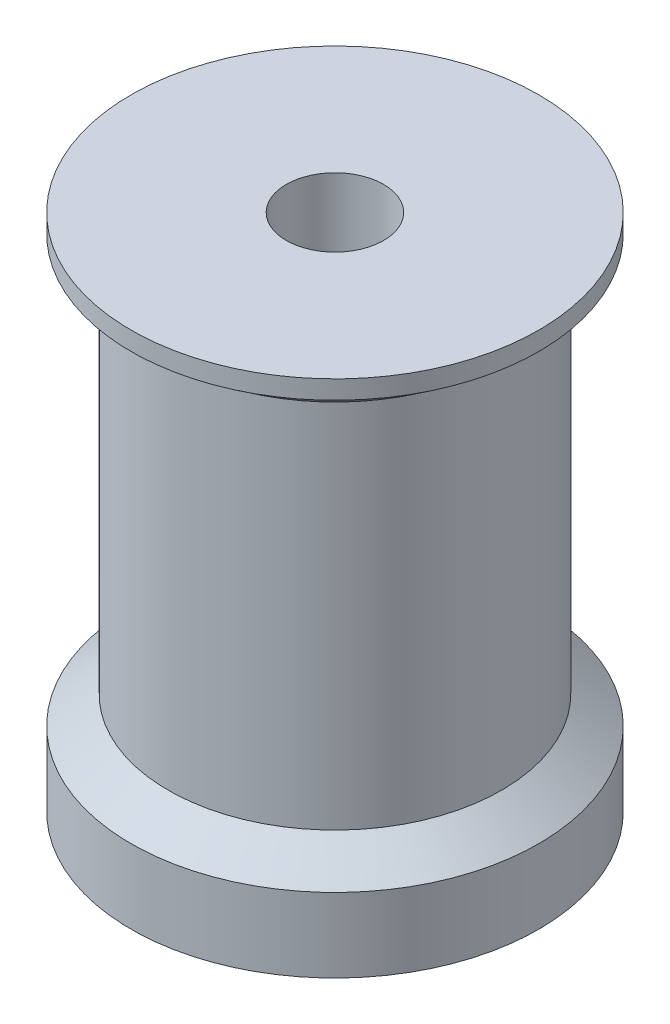
ISO-10303-21;
HEADER;
FILE_DESCRIPTION(('STEP AP214'),'2;1');
FILE_NAME('part.step','',(''),(''),'','','');
FILE_SCHEMA(('AUTOMOTIVE_DESIGN { 1 0 10303 214 1 1 1 1 }'));
ENDSEC;
DATA;
#1=APPLICATION_CONTEXT('core data for automotive mechanical design processes');
#2=APPLICATION_PROTOCOL_DEFINITION('international standard','automotive_design',2000,#1);
#3=PRODUCT_CONTEXT('',#1,'mechanical');
#4=PRODUCT('Part','Part','',(#3));
#5=PRODUCT_RELATED_PRODUCT_CATEGORY('part','',(#4));
#6=PRODUCT_DEFINITION_FORMATION('','',#4);
#7=PRODUCT_DEFINITION_CONTEXT('part definition',#1,'design');
#8=PRODUCT_DEFINITION('design','',#6,#7);
#9=PRODUCT_DEFINITION_SHAPE('','',#8);
#10=(LENGTH_UNIT() NAMED_UNIT(*) SI_UNIT(.MILLI.,.METRE.));
#11=(NAMED_UNIT(*) PLANE_ANGLE_UNIT() SI_UNIT($,.RADIAN.));
#12=(NAMED_UNIT(*) SI_UNIT($,.STERADIAN.) SOLID_ANGLE_UNIT());
#13=UNCERTAINTY_MEASURE_WITH_UNIT(LENGTH_MEASURE(1.E-05),#10,'distance_accuracy_value','');
#14=(GEOMETRIC_REPRESENTATION_CONTEXT(3) GLOBAL_UNCERTAINTY_ASSIGNED_CONTEXT((#13)) GLOBAL_UNIT_ASSIGNED_CONTEXT((#10,
#11,#12)) REPRESENTATION_CONTEXT('',''));
#15=CARTESIAN_POINT('',(0.,0.,0.));
#16=DIRECTION('',(0.,0.,1.));
#17=DIRECTION('',(1.,0.,0.));
#18=AXIS2_PLACEMENT_3D('',#15,#16,#17);
#19=CARTESIAN_POINT('',(-11.,0.,0.));
#20=DIRECTION('',(0.,1.,0.));
#21=DIRECTION('',(0.,0.,1.));
#22=AXIS2_PLACEMENT_3D('',#19,#20,#21);
#23=PLANE('',#22);
#24=CARTESIAN_POINT('',(0.,0.,0.));
#25=DIRECTION('',(0.,-1.,0.));
#26=DIRECTION('',(0.,0.,-1.));
#27=AXIS2_PLACEMENT_3D('',#24,#25,#26);
#28=CIRCLE('',#27,2.625);
#29=CARTESIAN_POINT('',(0.,0.,-2.625));
#30=VERTEX_POINT('',#29);
#31=EDGE_CURVE('E10',#30,#30,#28,.T.);
#32=ORIENTED_EDGE('',*,*,#31,.F.);
#33=EDGE_LOOP('',(#32));
#34=FACE_BOUND('',#33,.T.);
#35=CARTESIAN_POINT('',(0.,0.,0.));
#36=DIRECTION('',(0.,-1.,0.));
#37=DIRECTION('',(0.,0.,-1.));
#38=AXIS2_PLACEMENT_3D('',#35,#36,#37);
#39=CIRCLE('',#38,11.);
#40=CARTESIAN_POINT('',(0.,0.,-11.));
#41=VERTEX_POINT('',#40);
#42=EDGE_CURVE('E66',#41,#41,#39,.T.);
#43=ORIENTED_EDGE('',*,*,#42,.T.);
#44=EDGE_LOOP('',(#43));
#45=FACE_BOUND('',#44,.T.);
#46=ADVANCED_FACE('F30',(#34,#45),#23,.F.);
#47=CARTESIAN_POINT('',(0.,0.,0.));
#48=DIRECTION('',(0.,-1.,0.));
#49=DIRECTION('',(0.,0.,-1.));
#50=AXIS2_PLACEMENT_3D('',#47,#48,#49);
#51=CYLINDRICAL_SURFACE('',#50,2.625);
#52=CARTESIAN_POINT('',(0.,28.,0.));
#53=DIRECTION('',(0.,-1.,0.));
#54=DIRECTION('',(0.,0.,-1.));
#55=AXIS2_PLACEMENT_3D('',#52,#53,#54);
#56=CIRCLE('',#55,2.625);
#57=CARTESIAN_POINT('',(0.,28.,-2.625));
#58=VERTEX_POINT('',#57);
#59=EDGE_CURVE('E37',#58,#58,#56,.T.);
#60=ORIENTED_EDGE('',*,*,#59,.F.);
#61=EDGE_LOOP('',(#60));
#62=FACE_BOUND('',#61,.T.);
#63=ORIENTED_EDGE('',*,*,#31,.T.);
#64=EDGE_LOOP('',(#63));
#65=FACE_BOUND('',#64,.T.);
#66=ADVANCED_FACE('F103',(#62,#65),#51,.F.);
#67=CARTESIAN_POINT('',(-2.625,28.,0.));
#68=DIRECTION('',(0.,-1.,0.));
#69=DIRECTION('',(0.,0.,-1.));
#70=AXIS2_PLACEMENT_3D('',#67,#68,#69);
#71=PLANE('',#70);
#72=CARTESIAN_POINT('',(0.,28.,0.));
#73=DIRECTION('',(0.,-1.,0.));
#74=DIRECTION('',(0.,0.,-1.));
#75=AXIS2_PLACEMENT_3D('',#72,#73,#74);
#76=CIRCLE('',#75,11.);
#77=CARTESIAN_POINT('',(0.,28.,-11.));
#78=VERTEX_POINT('',#77);
#79=EDGE_CURVE('E43',#78,#78,#76,.T.);
#80=ORIENTED_EDGE('',*,*,#79,.F.);
#81=EDGE_LOOP('',(#80));
#82=FACE_BOUND('',#81,.T.);
#83=ORIENTED_EDGE('',*,*,#59,.T.);
#84=EDGE_LOOP('',(#83));
#85=FACE_BOUND('',#84,.T.);
#86=ADVANCED_FACE('F98',(#82,#85),#71,.F.);
#87=CARTESIAN_POINT('',(0.,0.,0.));
#88=DIRECTION('',(0.,-1.,0.));
#89=DIRECTION('',(0.,0.,-1.));
#90=AXIS2_PLACEMENT_3D('',#87,#88,#89);
#91=CYLINDRICAL_SURFACE('',#90,11.);
#92=CARTESIAN_POINT('',(0.,27.,0.));
#93=DIRECTION('',(0.,-1.,0.));
#94=DIRECTION('',(0.,0.,-1.));
#95=AXIS2_PLACEMENT_3D('',#92,#93,#94);
#96=CIRCLE('',#95,11.);
#97=CARTESIAN_POINT('',(0.,27.,-11.));
#98=VERTEX_POINT('',#97);
#99=EDGE_CURVE('E50',#98,#98,#96,.T.);
#100=ORIENTED_EDGE('',*,*,#99,.F.);
#101=EDGE_LOOP('',(#100));
#102=FACE_BOUND('',#101,.T.);
#103=ORIENTED_EDGE('',*,*,#79,.T.);
#104=EDGE_LOOP('',(#103));
#105=FACE_BOUND('',#104,.T.);
#106=ADVANCED_FACE('F92',(#102,#105),#91,.T.);
#107=CARTESIAN_POINT('',(0.,27.,0.));
#108=DIRECTION('',(0.,1.,0.));
#109=DIRECTION('',(0.,0.,1.));
#110=AXIS2_PLACEMENT_3D('',#107,#108,#109);
#111=CONICAL_SURFACE('',#110,11.,0.927295218001613);
#112=CARTESIAN_POINT('',(0.,25.5,0.));
#113=DIRECTION('',(0.,-1.,0.));
#114=DIRECTION('',(0.,0.,-1.));
#115=AXIS2_PLACEMENT_3D('',#112,#113,#114);
#116=CIRCLE('',#115,9.);
#117=CARTESIAN_POINT('',(0.,25.5,-9.));
#118=VERTEX_POINT('',#117);
#119=EDGE_CURVE('E55',#118,#118,#116,.T.);
#120=ORIENTED_EDGE('',*,*,#119,.F.);
#121=EDGE_LOOP('',(#120));
#122=FACE_BOUND('',#121,.T.);
#123=ORIENTED_EDGE('',*,*,#99,.T.);
#124=EDGE_LOOP('',(#123));
#125=FACE_BOUND('',#124,.T.);
#126=ADVANCED_FACE('F86',(#122,#125),#111,.T.);
#127=CARTESIAN_POINT('',(0.,0.,0.));
#128=DIRECTION('',(0.,-1.,0.));
#129=DIRECTION('',(0.,0.,-1.));
#130=AXIS2_PLACEMENT_3D('',#127,#128,#129);
#131=CYLINDRICAL_SURFACE('',#130,9.);
#132=CARTESIAN_POINT('',(0.,5.5,0.));
#133=DIRECTION('',(0.,-1.,0.));
#134=DIRECTION('',(0.,0.,-1.));
#135=AXIS2_PLACEMENT_3D('',#132,#133,#134);
#136=CIRCLE('',#135,9.);
#137=CARTESIAN_POINT('',(0.,5.5,-9.));
#138=VERTEX_POINT('',#137);
#139=EDGE_CURVE('E59',#138,#138,#136,.T.);
#140=ORIENTED_EDGE('',*,*,#139,.F.);
#141=EDGE_LOOP('',(#140));
#142=FACE_BOUND('',#141,.T.);
#143=ORIENTED_EDGE('',*,*,#119,.T.);
#144=EDGE_LOOP('',(#143));
#145=FACE_BOUND('',#144,.T.);
#146=ADVANCED_FACE('F80',(#142,#145),#131,.T.);
#147=CARTESIAN_POINT('',(0.,5.5,0.));
#148=DIRECTION('',(0.,-1.,0.));
#149=DIRECTION('',(0.,0.,-1.));
#150=AXIS2_PLACEMENT_3D('',#147,#148,#149);
#151=CONICAL_SURFACE('',#150,9.,0.927295218001613);
#152=CARTESIAN_POINT('',(0.,4.,0.));
#153=DIRECTION('',(0.,-1.,0.));
#154=DIRECTION('',(0.,0.,-1.));
#155=AXIS2_PLACEMENT_3D('',#152,#153,#154);
#156=CIRCLE('',#155,11.);
#157=CARTESIAN_POINT('',(0.,4.,-11.));
#158=VERTEX_POINT('',#157);
#159=EDGE_CURVE('E62',#158,#158,#156,.T.);
#160=ORIENTED_EDGE('',*,*,#159,.F.);
#161=EDGE_LOOP('',(#160));
#162=FACE_BOUND('',#161,.T.);
#163=ORIENTED_EDGE('',*,*,#139,.T.);
#164=EDGE_LOOP('',(#163));
#165=FACE_BOUND('',#164,.T.);
#166=ADVANCED_FACE('F74',(#162,#165),#151,.T.);
#167=CARTESIAN_POINT('',(0.,0.,0.));
#168=DIRECTION('',(0.,-1.,0.));
#169=DIRECTION('',(0.,0.,-1.));
#170=AXIS2_PLACEMENT_3D('',#167,#168,#169);
#171=CYLINDRICAL_SURFACE('',#170,11.);
#172=ORIENTED_EDGE('',*,*,#42,.F.);
#173=EDGE_LOOP('',(#172));
#174=FACE_BOUND('',#173,.T.);
#175=ORIENTED_EDGE('',*,*,#159,.T.);
#176=EDGE_LOOP('',(#175));
#177=FACE_BOUND('',#176,.T.);
#178=ADVANCED_FACE('F71',(#174,#177),#171,.T.);
#179=CLOSED_SHELL('',(#46,#66,#86,#106,#126,#146,#166,#178));
#180=MANIFOLD_SOLID_BREP('B2',#179);
#181=ADVANCED_BREP_SHAPE_REPRESENTATION('',(#18,#180),#14);
#182=SHAPE_DEFINITION_REPRESENTATION(#9,#181);
ENDSEC;
END-ISO-10303-21;
